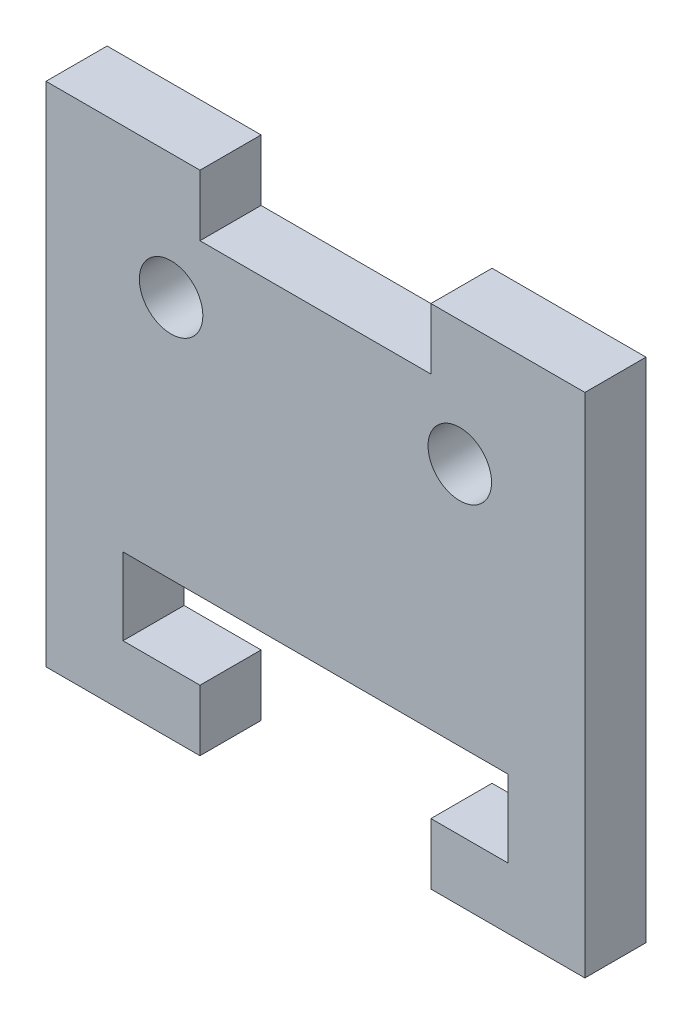
ISO-10303-21;
HEADER;
FILE_DESCRIPTION(('STEP AP214'),'2;1');
FILE_NAME('part.step','',(''),(''),'','','');
FILE_SCHEMA(('AUTOMOTIVE_DESIGN { 1 0 10303 214 1 1 1 1 }'));
ENDSEC;
DATA;
#1=APPLICATION_CONTEXT('core data for automotive mechanical design processes');
#2=APPLICATION_PROTOCOL_DEFINITION('international standard','automotive_design',2000,#1);
#3=PRODUCT_CONTEXT('',#1,'mechanical');
#4=PRODUCT('Part','Part','',(#3));
#5=PRODUCT_RELATED_PRODUCT_CATEGORY('part','',(#4));
#6=PRODUCT_DEFINITION_FORMATION('','',#4);
#7=PRODUCT_DEFINITION_CONTEXT('part definition',#1,'design');
#8=PRODUCT_DEFINITION('design','',#6,#7);
#9=PRODUCT_DEFINITION_SHAPE('','',#8);
#10=(LENGTH_UNIT() NAMED_UNIT(*) SI_UNIT(.MILLI.,.METRE.));
#11=(NAMED_UNIT(*) PLANE_ANGLE_UNIT() SI_UNIT($,.RADIAN.));
#12=(NAMED_UNIT(*) SI_UNIT($,.STERADIAN.) SOLID_ANGLE_UNIT());
#13=UNCERTAINTY_MEASURE_WITH_UNIT(LENGTH_MEASURE(1.E-05),#10,'distance_accuracy_value','');
#14=(GEOMETRIC_REPRESENTATION_CONTEXT(3) GLOBAL_UNCERTAINTY_ASSIGNED_CONTEXT((#13)) GLOBAL_UNIT_ASSIGNED_CONTEXT((#10,
#11,#12)) REPRESENTATION_CONTEXT('',''));
#15=CARTESIAN_POINT('',(0.,0.,0.));
#16=DIRECTION('',(0.,0.,1.));
#17=DIRECTION('',(1.,0.,0.));
#18=AXIS2_PLACEMENT_3D('',#15,#16,#17);
#19=CARTESIAN_POINT('',(10.,0.,3.175));
#20=DIRECTION('',(-1.,0.,0.));
#21=DIRECTION('',(0.,0.,1.));
#22=AXIS2_PLACEMENT_3D('',#19,#20,#21);
#23=PLANE('',#22);
#24=DIRECTION('',(0.,1.,0.));
#25=VECTOR('',#24,1.);
#26=CARTESIAN_POINT('',(10.,0.,0.));
#27=LINE('',#26,#25);
#28=CARTESIAN_POINT('',(10.,-10.,0.));
#29=VERTEX_POINT('',#28);
#30=CARTESIAN_POINT('',(10.,-6.,0.));
#31=VERTEX_POINT('',#30);
#32=EDGE_CURVE('E241',#29,#31,#27,.T.);
#33=ORIENTED_EDGE('',*,*,#32,.F.);
#34=DIRECTION('',(0.,0.,-1.));
#35=VECTOR('',#34,1.);
#36=CARTESIAN_POINT('',(10.,-10.,3.175));
#37=LINE('',#36,#35);
#38=CARTESIAN_POINT('',(10.,-10.,3.175));
#39=VERTEX_POINT('',#38);
#40=EDGE_CURVE('E11',#39,#29,#37,.T.);
#41=ORIENTED_EDGE('',*,*,#40,.F.);
#42=DIRECTION('',(0.,1.,0.));
#43=VECTOR('',#42,1.);
#44=CARTESIAN_POINT('',(10.,0.,3.175));
#45=LINE('',#44,#43);
#46=CARTESIAN_POINT('',(10.,-6.,3.175));
#47=VERTEX_POINT('',#46);
#48=EDGE_CURVE('E182',#39,#47,#45,.T.);
#49=ORIENTED_EDGE('',*,*,#48,.T.);
#50=DIRECTION('',(0.,0.,-1.));
#51=VECTOR('',#50,1.);
#52=CARTESIAN_POINT('',(10.,-6.,3.175));
#53=LINE('',#52,#51);
#54=EDGE_CURVE('E111',#47,#31,#53,.T.);
#55=ORIENTED_EDGE('',*,*,#54,.T.);
#56=EDGE_LOOP('',(#33,#41,#49,#55));
#57=FACE_BOUND('',#56,.T.);
#58=ADVANCED_FACE('F35',(#57),#23,.T.);
#59=CARTESIAN_POINT('',(0.,-10.,3.175));
#60=DIRECTION('',(0.,1.,0.));
#61=DIRECTION('',(0.,0.,1.));
#62=AXIS2_PLACEMENT_3D('',#59,#60,#61);
#63=PLANE('',#62);
#64=DIRECTION('',(1.,0.,0.));
#65=VECTOR('',#64,1.);
#66=CARTESIAN_POINT('',(0.,-10.,0.));
#67=LINE('',#66,#65);
#68=CARTESIAN_POINT('',(6.,-10.,0.));
#69=VERTEX_POINT('',#68);
#70=EDGE_CURVE('E236',#69,#29,#67,.T.);
#71=ORIENTED_EDGE('',*,*,#70,.F.);
#72=DIRECTION('',(0.,0.,-1.));
#73=VECTOR('',#72,1.);
#74=CARTESIAN_POINT('',(6.,-10.,3.175));
#75=LINE('',#74,#73);
#76=CARTESIAN_POINT('',(6.,-10.,3.175));
#77=VERTEX_POINT('',#76);
#78=EDGE_CURVE('E44',#77,#69,#75,.T.);
#79=ORIENTED_EDGE('',*,*,#78,.F.);
#80=DIRECTION('',(1.,0.,0.));
#81=VECTOR('',#80,1.);
#82=CARTESIAN_POINT('',(0.,-10.,3.175));
#83=LINE('',#82,#81);
#84=EDGE_CURVE('E175',#77,#39,#83,.T.);
#85=ORIENTED_EDGE('',*,*,#84,.T.);
#86=ORIENTED_EDGE('',*,*,#40,.T.);
#87=EDGE_LOOP('',(#71,#79,#85,#86));
#88=FACE_BOUND('',#87,.T.);
#89=ADVANCED_FACE('F240',(#88),#63,.T.);
#90=CARTESIAN_POINT('',(6.,0.,3.175));
#91=DIRECTION('',(1.,0.,0.));
#92=DIRECTION('',(0.,0.,-1.));
#93=AXIS2_PLACEMENT_3D('',#90,#91,#92);
#94=PLANE('',#93);
#95=DIRECTION('',(0.,-1.,0.));
#96=VECTOR('',#95,1.);
#97=CARTESIAN_POINT('',(6.,0.,0.));
#98=LINE('',#97,#96);
#99=CARTESIAN_POINT('',(6.,-13.175,0.));
#100=VERTEX_POINT('',#99);
#101=EDGE_CURVE('E232',#69,#100,#98,.T.);
#102=ORIENTED_EDGE('',*,*,#101,.T.);
#103=DIRECTION('',(0.,0.,-1.));
#104=VECTOR('',#103,1.);
#105=CARTESIAN_POINT('',(6.,-13.175,3.175));
#106=LINE('',#105,#104);
#107=CARTESIAN_POINT('',(6.,-13.175,3.175));
#108=VERTEX_POINT('',#107);
#109=EDGE_CURVE('E224',#108,#100,#106,.T.);
#110=ORIENTED_EDGE('',*,*,#109,.F.);
#111=DIRECTION('',(0.,-1.,0.));
#112=VECTOR('',#111,1.);
#113=CARTESIAN_POINT('',(6.,0.,3.175));
#114=LINE('',#113,#112);
#115=EDGE_CURVE('E181',#77,#108,#114,.T.);
#116=ORIENTED_EDGE('',*,*,#115,.F.);
#117=ORIENTED_EDGE('',*,*,#78,.T.);
#118=EDGE_LOOP('',(#102,#110,#116,#117));
#119=FACE_BOUND('',#118,.T.);
#120=ADVANCED_FACE('F230',(#119),#94,.F.);
#121=CARTESIAN_POINT('',(0.,-13.175,3.175));
#122=DIRECTION('',(0.,1.,0.));
#123=DIRECTION('',(0.,0.,1.));
#124=AXIS2_PLACEMENT_3D('',#121,#122,#123);
#125=PLANE('',#124);
#126=DIRECTION('',(1.,0.,0.));
#127=VECTOR('',#126,1.);
#128=CARTESIAN_POINT('',(0.,-13.175,0.));
#129=LINE('',#128,#127);
#130=CARTESIAN_POINT('',(14.,-13.175,0.));
#131=VERTEX_POINT('',#130);
#132=EDGE_CURVE('E238',#100,#131,#129,.T.);
#133=ORIENTED_EDGE('',*,*,#132,.T.);
#134=DIRECTION('',(0.,0.,-1.));
#135=VECTOR('',#134,1.);
#136=CARTESIAN_POINT('',(14.,-13.175,3.175));
#137=LINE('',#136,#135);
#138=CARTESIAN_POINT('',(14.,-13.175,3.175));
#139=VERTEX_POINT('',#138);
#140=EDGE_CURVE('E221',#139,#131,#137,.T.);
#141=ORIENTED_EDGE('',*,*,#140,.F.);
#142=DIRECTION('',(1.,0.,0.));
#143=VECTOR('',#142,1.);
#144=CARTESIAN_POINT('',(0.,-13.175,3.175));
#145=LINE('',#144,#143);
#146=EDGE_CURVE('E186',#108,#139,#145,.T.);
#147=ORIENTED_EDGE('',*,*,#146,.F.);
#148=ORIENTED_EDGE('',*,*,#109,.T.);
#149=EDGE_LOOP('',(#133,#141,#147,#148));
#150=FACE_BOUND('',#149,.T.);
#151=ADVANCED_FACE('F275',(#150),#125,.F.);
#152=CARTESIAN_POINT('',(14.,0.,3.175));
#153=DIRECTION('',(-1.,0.,0.));
#154=DIRECTION('',(0.,0.,1.));
#155=AXIS2_PLACEMENT_3D('',#152,#153,#154);
#156=PLANE('',#155);
#157=DIRECTION('',(0.,1.,0.));
#158=VECTOR('',#157,1.);
#159=CARTESIAN_POINT('',(14.,0.,0.));
#160=LINE('',#159,#158);
#161=CARTESIAN_POINT('',(14.,13.175,0.));
#162=VERTEX_POINT('',#161);
#163=EDGE_CURVE('E270',#131,#162,#160,.T.);
#164=ORIENTED_EDGE('',*,*,#163,.T.);
#165=DIRECTION('',(0.,0.,-1.));
#166=VECTOR('',#165,1.);
#167=CARTESIAN_POINT('',(14.,13.175,3.175));
#168=LINE('',#167,#166);
#169=CARTESIAN_POINT('',(14.,13.175,3.175));
#170=VERTEX_POINT('',#169);
#171=EDGE_CURVE('E219',#170,#162,#168,.T.);
#172=ORIENTED_EDGE('',*,*,#171,.F.);
#173=DIRECTION('',(0.,1.,0.));
#174=VECTOR('',#173,1.);
#175=CARTESIAN_POINT('',(14.,0.,3.175));
#176=LINE('',#175,#174);
#177=EDGE_CURVE('E277',#139,#170,#176,.T.);
#178=ORIENTED_EDGE('',*,*,#177,.F.);
#179=ORIENTED_EDGE('',*,*,#140,.T.);
#180=EDGE_LOOP('',(#164,#172,#178,#179));
#181=FACE_BOUND('',#180,.T.);
#182=ADVANCED_FACE('F328',(#181),#156,.F.);
#183=CARTESIAN_POINT('',(0.,13.175,3.175));
#184=DIRECTION('',(0.,1.,0.));
#185=DIRECTION('',(0.,0.,1.));
#186=AXIS2_PLACEMENT_3D('',#183,#184,#185);
#187=PLANE('',#186);
#188=DIRECTION('',(1.,0.,0.));
#189=VECTOR('',#188,1.);
#190=CARTESIAN_POINT('',(0.,13.175,0.));
#191=LINE('',#190,#189);
#192=CARTESIAN_POINT('',(6.,13.175,0.));
#193=VERTEX_POINT('',#192);
#194=EDGE_CURVE('E267',#193,#162,#191,.T.);
#195=ORIENTED_EDGE('',*,*,#194,.F.);
#196=DIRECTION('',(0.,0.,-1.));
#197=VECTOR('',#196,1.);
#198=CARTESIAN_POINT('',(6.,13.175,3.175));
#199=LINE('',#198,#197);
#200=CARTESIAN_POINT('',(6.,13.175,3.175));
#201=VERTEX_POINT('',#200);
#202=EDGE_CURVE('E217',#201,#193,#199,.T.);
#203=ORIENTED_EDGE('',*,*,#202,.F.);
#204=DIRECTION('',(1.,0.,0.));
#205=VECTOR('',#204,1.);
#206=CARTESIAN_POINT('',(0.,13.175,3.175));
#207=LINE('',#206,#205);
#208=EDGE_CURVE('E279',#201,#170,#207,.T.);
#209=ORIENTED_EDGE('',*,*,#208,.T.);
#210=ORIENTED_EDGE('',*,*,#171,.T.);
#211=EDGE_LOOP('',(#195,#203,#209,#210));
#212=FACE_BOUND('',#211,.T.);
#213=ADVANCED_FACE('F331',(#212),#187,.T.);
#214=CARTESIAN_POINT('',(6.,0.,3.175));
#215=DIRECTION('',(-1.,0.,0.));
#216=DIRECTION('',(0.,0.,1.));
#217=AXIS2_PLACEMENT_3D('',#214,#215,#216);
#218=PLANE('',#217);
#219=DIRECTION('',(0.,1.,0.));
#220=VECTOR('',#219,1.);
#221=CARTESIAN_POINT('',(6.,0.,0.));
#222=LINE('',#221,#220);
#223=CARTESIAN_POINT('',(6.,10.,0.));
#224=VERTEX_POINT('',#223);
#225=EDGE_CURVE('E264',#224,#193,#222,.T.);
#226=ORIENTED_EDGE('',*,*,#225,.F.);
#227=DIRECTION('',(0.,0.,-1.));
#228=VECTOR('',#227,1.);
#229=CARTESIAN_POINT('',(6.,10.,3.175));
#230=LINE('',#229,#228);
#231=CARTESIAN_POINT('',(6.,10.,3.175));
#232=VERTEX_POINT('',#231);
#233=EDGE_CURVE('E215',#232,#224,#230,.T.);
#234=ORIENTED_EDGE('',*,*,#233,.F.);
#235=DIRECTION('',(0.,1.,0.));
#236=VECTOR('',#235,1.);
#237=CARTESIAN_POINT('',(6.,0.,3.175));
#238=LINE('',#237,#236);
#239=EDGE_CURVE('E284',#232,#201,#238,.T.);
#240=ORIENTED_EDGE('',*,*,#239,.T.);
#241=ORIENTED_EDGE('',*,*,#202,.T.);
#242=EDGE_LOOP('',(#226,#234,#240,#241));
#243=FACE_BOUND('',#242,.T.);
#244=ADVANCED_FACE('F335',(#243),#218,.T.);
#245=CARTESIAN_POINT('',(0.,10.,3.175));
#246=DIRECTION('',(0.,1.,0.));
#247=DIRECTION('',(0.,0.,1.));
#248=AXIS2_PLACEMENT_3D('',#245,#246,#247);
#249=PLANE('',#248);
#250=DIRECTION('',(1.,0.,0.));
#251=VECTOR('',#250,1.);
#252=CARTESIAN_POINT('',(0.,10.,0.));
#253=LINE('',#252,#251);
#254=CARTESIAN_POINT('',(-6.,10.,0.));
#255=VERTEX_POINT('',#254);
#256=EDGE_CURVE('E261',#255,#224,#253,.T.);
#257=ORIENTED_EDGE('',*,*,#256,.F.);
#258=DIRECTION('',(0.,0.,-1.));
#259=VECTOR('',#258,1.);
#260=CARTESIAN_POINT('',(-6.,10.,3.175));
#261=LINE('',#260,#259);
#262=CARTESIAN_POINT('',(-6.,10.,3.175));
#263=VERTEX_POINT('',#262);
#264=EDGE_CURVE('E213',#263,#255,#261,.T.);
#265=ORIENTED_EDGE('',*,*,#264,.F.);
#266=DIRECTION('',(1.,0.,0.));
#267=VECTOR('',#266,1.);
#268=CARTESIAN_POINT('',(0.,10.,3.175));
#269=LINE('',#268,#267);
#270=EDGE_CURVE('E287',#263,#232,#269,.T.);
#271=ORIENTED_EDGE('',*,*,#270,.T.);
#272=ORIENTED_EDGE('',*,*,#233,.T.);
#273=EDGE_LOOP('',(#257,#265,#271,#272));
#274=FACE_BOUND('',#273,.T.);
#275=ADVANCED_FACE('F339',(#274),#249,.T.);
#276=CARTESIAN_POINT('',(-6.,0.,3.175));
#277=DIRECTION('',(1.,0.,0.));
#278=DIRECTION('',(0.,0.,-1.));
#279=AXIS2_PLACEMENT_3D('',#276,#277,#278);
#280=PLANE('',#279);
#281=DIRECTION('',(0.,-1.,0.));
#282=VECTOR('',#281,1.);
#283=CARTESIAN_POINT('',(-6.,0.,0.));
#284=LINE('',#283,#282);
#285=CARTESIAN_POINT('',(-6.,13.175,0.));
#286=VERTEX_POINT('',#285);
#287=EDGE_CURVE('E258',#286,#255,#284,.T.);
#288=ORIENTED_EDGE('',*,*,#287,.F.);
#289=DIRECTION('',(0.,0.,-1.));
#290=VECTOR('',#289,1.);
#291=CARTESIAN_POINT('',(-6.,13.175,3.175));
#292=LINE('',#291,#290);
#293=CARTESIAN_POINT('',(-6.,13.175,3.175));
#294=VERTEX_POINT('',#293);
#295=EDGE_CURVE('E211',#294,#286,#292,.T.);
#296=ORIENTED_EDGE('',*,*,#295,.F.);
#297=DIRECTION('',(0.,-1.,0.));
#298=VECTOR('',#297,1.);
#299=CARTESIAN_POINT('',(-6.,0.,3.175));
#300=LINE('',#299,#298);
#301=EDGE_CURVE('E290',#294,#263,#300,.T.);
#302=ORIENTED_EDGE('',*,*,#301,.T.);
#303=ORIENTED_EDGE('',*,*,#264,.T.);
#304=EDGE_LOOP('',(#288,#296,#302,#303));
#305=FACE_BOUND('',#304,.T.);
#306=ADVANCED_FACE('F343',(#305),#280,.T.);
#307=CARTESIAN_POINT('',(0.,13.175,3.175));
#308=DIRECTION('',(0.,1.,0.));
#309=DIRECTION('',(0.,0.,1.));
#310=AXIS2_PLACEMENT_3D('',#307,#308,#309);
#311=PLANE('',#310);
#312=DIRECTION('',(1.,0.,0.));
#313=VECTOR('',#312,1.);
#314=CARTESIAN_POINT('',(0.,13.175,0.));
#315=LINE('',#314,#313);
#316=CARTESIAN_POINT('',(-14.,13.175,0.));
#317=VERTEX_POINT('',#316);
#318=EDGE_CURVE('E255',#317,#286,#315,.T.);
#319=ORIENTED_EDGE('',*,*,#318,.F.);
#320=DIRECTION('',(0.,0.,-1.));
#321=VECTOR('',#320,1.);
#322=CARTESIAN_POINT('',(-14.,13.175,3.175));
#323=LINE('',#322,#321);
#324=CARTESIAN_POINT('',(-14.,13.175,3.175));
#325=VERTEX_POINT('',#324);
#326=EDGE_CURVE('E209',#325,#317,#323,.T.);
#327=ORIENTED_EDGE('',*,*,#326,.F.);
#328=DIRECTION('',(1.,0.,0.));
#329=VECTOR('',#328,1.);
#330=CARTESIAN_POINT('',(0.,13.175,3.175));
#331=LINE('',#330,#329);
#332=EDGE_CURVE('E293',#325,#294,#331,.T.);
#333=ORIENTED_EDGE('',*,*,#332,.T.);
#334=ORIENTED_EDGE('',*,*,#295,.T.);
#335=EDGE_LOOP('',(#319,#327,#333,#334));
#336=FACE_BOUND('',#335,.T.);
#337=ADVANCED_FACE('F347',(#336),#311,.T.);
#338=CARTESIAN_POINT('',(-14.,0.,3.175));
#339=DIRECTION('',(-1.,0.,0.));
#340=DIRECTION('',(0.,0.,1.));
#341=AXIS2_PLACEMENT_3D('',#338,#339,#340);
#342=PLANE('',#341);
#343=DIRECTION('',(0.,1.,0.));
#344=VECTOR('',#343,1.);
#345=CARTESIAN_POINT('',(-14.,0.,0.));
#346=LINE('',#345,#344);
#347=CARTESIAN_POINT('',(-14.,-13.175,0.));
#348=VERTEX_POINT('',#347);
#349=EDGE_CURVE('E250',#348,#317,#346,.T.);
#350=ORIENTED_EDGE('',*,*,#349,.F.);
#351=DIRECTION('',(0.,0.,-1.));
#352=VECTOR('',#351,1.);
#353=CARTESIAN_POINT('',(-14.,-13.175,3.175));
#354=LINE('',#353,#352);
#355=CARTESIAN_POINT('',(-14.,-13.175,3.175));
#356=VERTEX_POINT('',#355);
#357=EDGE_CURVE('E207',#356,#348,#354,.T.);
#358=ORIENTED_EDGE('',*,*,#357,.F.);
#359=DIRECTION('',(0.,1.,0.));
#360=VECTOR('',#359,1.);
#361=CARTESIAN_POINT('',(-14.,0.,3.175));
#362=LINE('',#361,#360);
#363=EDGE_CURVE('E296',#356,#325,#362,.T.);
#364=ORIENTED_EDGE('',*,*,#363,.T.);
#365=ORIENTED_EDGE('',*,*,#326,.T.);
#366=EDGE_LOOP('',(#350,#358,#364,#365));
#367=FACE_BOUND('',#366,.T.);
#368=ADVANCED_FACE('F351',(#367),#342,.T.);
#369=CARTESIAN_POINT('',(0.,-13.175,3.175));
#370=DIRECTION('',(0.,1.,0.));
#371=DIRECTION('',(0.,0.,1.));
#372=AXIS2_PLACEMENT_3D('',#369,#370,#371);
#373=PLANE('',#372);
#374=DIRECTION('',(1.,0.,0.));
#375=VECTOR('',#374,1.);
#376=CARTESIAN_POINT('',(0.,-13.175,0.));
#377=LINE('',#376,#375);
#378=CARTESIAN_POINT('',(-6.,-13.175,0.));
#379=VERTEX_POINT('',#378);
#380=EDGE_CURVE('E247',#348,#379,#377,.T.);
#381=ORIENTED_EDGE('',*,*,#380,.T.);
#382=DIRECTION('',(0.,0.,-1.));
#383=VECTOR('',#382,1.);
#384=CARTESIAN_POINT('',(-6.,-13.175,3.175));
#385=LINE('',#384,#383);
#386=CARTESIAN_POINT('',(-6.,-13.175,3.175));
#387=VERTEX_POINT('',#386);
#388=EDGE_CURVE('E204',#387,#379,#385,.T.);
#389=ORIENTED_EDGE('',*,*,#388,.F.);
#390=DIRECTION('',(1.,0.,0.));
#391=VECTOR('',#390,1.);
#392=CARTESIAN_POINT('',(0.,-13.175,3.175));
#393=LINE('',#392,#391);
#394=EDGE_CURVE('E176',#356,#387,#393,.T.);
#395=ORIENTED_EDGE('',*,*,#394,.F.);
#396=ORIENTED_EDGE('',*,*,#357,.T.);
#397=EDGE_LOOP('',(#381,#389,#395,#396));
#398=FACE_BOUND('',#397,.T.);
#399=ADVANCED_FACE('F355',(#398),#373,.F.);
#400=CARTESIAN_POINT('',(-6.,0.,3.175));
#401=DIRECTION('',(-1.,0.,0.));
#402=DIRECTION('',(0.,0.,1.));
#403=AXIS2_PLACEMENT_3D('',#400,#401,#402);
#404=PLANE('',#403);
#405=DIRECTION('',(0.,1.,0.));
#406=VECTOR('',#405,1.);
#407=CARTESIAN_POINT('',(-6.,0.,0.));
#408=LINE('',#407,#406);
#409=CARTESIAN_POINT('',(-6.,-10.,0.));
#410=VERTEX_POINT('',#409);
#411=EDGE_CURVE('E245',#379,#410,#408,.T.);
#412=ORIENTED_EDGE('',*,*,#411,.T.);
#413=DIRECTION('',(0.,0.,-1.));
#414=VECTOR('',#413,1.);
#415=CARTESIAN_POINT('',(-6.,-10.,3.175));
#416=LINE('',#415,#414);
#417=CARTESIAN_POINT('',(-6.,-10.,3.175));
#418=VERTEX_POINT('',#417);
#419=EDGE_CURVE('E163',#418,#410,#416,.T.);
#420=ORIENTED_EDGE('',*,*,#419,.F.);
#421=DIRECTION('',(0.,1.,0.));
#422=VECTOR('',#421,1.);
#423=CARTESIAN_POINT('',(-6.,0.,3.175));
#424=LINE('',#423,#422);
#425=EDGE_CURVE('E172',#387,#418,#424,.T.);
#426=ORIENTED_EDGE('',*,*,#425,.F.);
#427=ORIENTED_EDGE('',*,*,#388,.T.);
#428=EDGE_LOOP('',(#412,#420,#426,#427));
#429=FACE_BOUND('',#428,.T.);
#430=ADVANCED_FACE('F359',(#429),#404,.F.);
#431=CARTESIAN_POINT('',(-10.,-10.,0.));
#432=VERTEX_POINT('',#431);
#433=EDGE_CURVE('E160',#432,#410,#67,.T.);
#434=ORIENTED_EDGE('',*,*,#433,.F.);
#435=DIRECTION('',(0.,0.,-1.));
#436=VECTOR('',#435,1.);
#437=CARTESIAN_POINT('',(-10.,-10.,3.175));
#438=LINE('',#437,#436);
#439=CARTESIAN_POINT('',(-10.,-10.,3.175));
#440=VERTEX_POINT('',#439);
#441=EDGE_CURVE('E154',#440,#432,#438,.T.);
#442=ORIENTED_EDGE('',*,*,#441,.F.);
#443=EDGE_CURVE('E158',#440,#418,#83,.T.);
#444=ORIENTED_EDGE('',*,*,#443,.T.);
#445=ORIENTED_EDGE('',*,*,#419,.T.);
#446=EDGE_LOOP('',(#434,#442,#444,#445));
#447=FACE_BOUND('',#446,.T.);
#448=ADVANCED_FACE('F156',(#447),#63,.T.);
#449=CARTESIAN_POINT('',(-10.,0.,3.175));
#450=DIRECTION('',(-1.,0.,0.));
#451=DIRECTION('',(0.,0.,1.));
#452=AXIS2_PLACEMENT_3D('',#449,#450,#451);
#453=PLANE('',#452);
#454=DIRECTION('',(0.,1.,0.));
#455=VECTOR('',#454,1.);
#456=CARTESIAN_POINT('',(-10.,0.,0.));
#457=LINE('',#456,#455);
#458=CARTESIAN_POINT('',(-10.,-6.,0.));
#459=VERTEX_POINT('',#458);
#460=EDGE_CURVE('E195',#432,#459,#457,.T.);
#461=ORIENTED_EDGE('',*,*,#460,.T.);
#462=DIRECTION('',(0.,0.,-1.));
#463=VECTOR('',#462,1.);
#464=CARTESIAN_POINT('',(-10.,-6.,3.175));
#465=LINE('',#464,#463);
#466=CARTESIAN_POINT('',(-10.,-6.,3.175));
#467=VERTEX_POINT('',#466);
#468=EDGE_CURVE('E164',#467,#459,#465,.T.);
#469=ORIENTED_EDGE('',*,*,#468,.F.);
#470=DIRECTION('',(0.,1.,0.));
#471=VECTOR('',#470,1.);
#472=CARTESIAN_POINT('',(-10.,0.,3.175));
#473=LINE('',#472,#471);
#474=EDGE_CURVE('E167',#440,#467,#473,.T.);
#475=ORIENTED_EDGE('',*,*,#474,.F.);
#476=ORIENTED_EDGE('',*,*,#441,.T.);
#477=EDGE_LOOP('',(#461,#469,#475,#476));
#478=FACE_BOUND('',#477,.T.);
#479=ADVANCED_FACE('F168',(#478),#453,.F.);
#480=CARTESIAN_POINT('',(7.5,6.7,3.175));
#481=DIRECTION('',(0.,0.,-1.));
#482=DIRECTION('',(-1.,0.,0.));
#483=AXIS2_PLACEMENT_3D('',#480,#481,#482);
#484=CYLINDRICAL_SURFACE('',#483,1.65);
#485=CARTESIAN_POINT('',(7.5,6.7,3.175));
#486=DIRECTION('',(0.,0.,1.));
#487=DIRECTION('',(1.,0.,0.));
#488=AXIS2_PLACEMENT_3D('',#485,#486,#487);
#489=CIRCLE('',#488,1.65);
#490=CARTESIAN_POINT('',(9.15,6.7,3.175));
#491=VERTEX_POINT('',#490);
#492=EDGE_CURVE('E187',#491,#491,#489,.T.);
#493=ORIENTED_EDGE('',*,*,#492,.T.);
#494=EDGE_LOOP('',(#493));
#495=FACE_BOUND('',#494,.T.);
#496=CARTESIAN_POINT('',(7.5,6.7,0.));
#497=DIRECTION('',(0.,0.,1.));
#498=DIRECTION('',(1.,0.,0.));
#499=AXIS2_PLACEMENT_3D('',#496,#497,#498);
#500=CIRCLE('',#499,1.65);
#501=CARTESIAN_POINT('',(9.15,6.7,0.));
#502=VERTEX_POINT('',#501);
#503=EDGE_CURVE('E243',#502,#502,#500,.T.);
#504=ORIENTED_EDGE('',*,*,#503,.F.);
#505=EDGE_LOOP('',(#504));
#506=FACE_BOUND('',#505,.T.);
#507=ADVANCED_FACE('F308',(#495,#506),#484,.F.);
#508=CARTESIAN_POINT('',(-7.5,6.7,3.175));
#509=DIRECTION('',(0.,0.,-1.));
#510=DIRECTION('',(-1.,0.,0.));
#511=AXIS2_PLACEMENT_3D('',#508,#509,#510);
#512=CYLINDRICAL_SURFACE('',#511,1.65);
#513=CARTESIAN_POINT('',(-7.5,6.7,3.175));
#514=DIRECTION('',(0.,0.,1.));
#515=DIRECTION('',(1.,0.,0.));
#516=AXIS2_PLACEMENT_3D('',#513,#514,#515);
#517=CIRCLE('',#516,1.65);
#518=CARTESIAN_POINT('',(-5.85,6.7,3.175));
#519=VERTEX_POINT('',#518);
#520=EDGE_CURVE('E189',#519,#519,#517,.T.);
#521=ORIENTED_EDGE('',*,*,#520,.T.);
#522=EDGE_LOOP('',(#521));
#523=FACE_BOUND('',#522,.T.);
#524=CARTESIAN_POINT('',(-7.5,6.7,0.));
#525=DIRECTION('',(0.,0.,1.));
#526=DIRECTION('',(1.,0.,0.));
#527=AXIS2_PLACEMENT_3D('',#524,#525,#526);
#528=CIRCLE('',#527,1.65);
#529=CARTESIAN_POINT('',(-5.85,6.7,0.));
#530=VERTEX_POINT('',#529);
#531=EDGE_CURVE('E301',#530,#530,#528,.T.);
#532=ORIENTED_EDGE('',*,*,#531,.F.);
#533=EDGE_LOOP('',(#532));
#534=FACE_BOUND('',#533,.T.);
#535=ADVANCED_FACE('F37',(#523,#534),#512,.F.);
#536=CARTESIAN_POINT('',(0.,-6.,3.175));
#537=DIRECTION('',(0.,1.,0.));
#538=DIRECTION('',(0.,0.,1.));
#539=AXIS2_PLACEMENT_3D('',#536,#537,#538);
#540=PLANE('',#539);
#541=DIRECTION('',(1.,0.,0.));
#542=VECTOR('',#541,1.);
#543=CARTESIAN_POINT('',(0.,-6.,0.));
#544=LINE('',#543,#542);
#545=EDGE_CURVE('E104',#459,#31,#544,.T.);
#546=ORIENTED_EDGE('',*,*,#545,.T.);
#547=ORIENTED_EDGE('',*,*,#54,.F.);
#548=DIRECTION('',(1.,0.,0.));
#549=VECTOR('',#548,1.);
#550=CARTESIAN_POINT('',(0.,-6.,3.175));
#551=LINE('',#550,#549);
#552=EDGE_CURVE('E52',#467,#47,#551,.T.);
#553=ORIENTED_EDGE('',*,*,#552,.F.);
#554=ORIENTED_EDGE('',*,*,#468,.T.);
#555=EDGE_LOOP('',(#546,#547,#553,#554));
#556=FACE_BOUND('',#555,.T.);
#557=ADVANCED_FACE('F315',(#556),#540,.F.);
#558=CARTESIAN_POINT('',(0.,0.,3.175));
#559=DIRECTION('',(0.,0.,1.));
#560=DIRECTION('',(1.,0.,0.));
#561=AXIS2_PLACEMENT_3D('',#558,#559,#560);
#562=PLANE('',#561);
#563=ORIENTED_EDGE('',*,*,#520,.F.);
#564=EDGE_LOOP('',(#563));
#565=FACE_BOUND('',#564,.T.);
#566=ORIENTED_EDGE('',*,*,#492,.F.);
#567=EDGE_LOOP('',(#566));
#568=FACE_BOUND('',#567,.T.);
#569=ORIENTED_EDGE('',*,*,#48,.F.);
#570=ORIENTED_EDGE('',*,*,#84,.F.);
#571=ORIENTED_EDGE('',*,*,#115,.T.);
#572=ORIENTED_EDGE('',*,*,#146,.T.);
#573=ORIENTED_EDGE('',*,*,#177,.T.);
#574=ORIENTED_EDGE('',*,*,#208,.F.);
#575=ORIENTED_EDGE('',*,*,#239,.F.);
#576=ORIENTED_EDGE('',*,*,#270,.F.);
#577=ORIENTED_EDGE('',*,*,#301,.F.);
#578=ORIENTED_EDGE('',*,*,#332,.F.);
#579=ORIENTED_EDGE('',*,*,#363,.F.);
#580=ORIENTED_EDGE('',*,*,#394,.T.);
#581=ORIENTED_EDGE('',*,*,#425,.T.);
#582=ORIENTED_EDGE('',*,*,#443,.F.);
#583=ORIENTED_EDGE('',*,*,#474,.T.);
#584=ORIENTED_EDGE('',*,*,#552,.T.);
#585=EDGE_LOOP('',(#569,#570,#571,#572,#573,#574,#575,#576,#577,#578,#579,#580,#581,#582,#583,#584));
#586=FACE_BOUND('',#585,.T.);
#587=ADVANCED_FACE('F170',(#565,#568,#586),#562,.T.);
#588=CARTESIAN_POINT('',(0.,0.,0.));
#589=DIRECTION('',(0.,0.,1.));
#590=DIRECTION('',(1.,0.,0.));
#591=AXIS2_PLACEMENT_3D('',#588,#589,#590);
#592=PLANE('',#591);
#593=ORIENTED_EDGE('',*,*,#531,.T.);
#594=EDGE_LOOP('',(#593));
#595=FACE_BOUND('',#594,.T.);
#596=ORIENTED_EDGE('',*,*,#503,.T.);
#597=EDGE_LOOP('',(#596));
#598=FACE_BOUND('',#597,.T.);
#599=ORIENTED_EDGE('',*,*,#32,.T.);
#600=ORIENTED_EDGE('',*,*,#545,.F.);
#601=ORIENTED_EDGE('',*,*,#460,.F.);
#602=ORIENTED_EDGE('',*,*,#433,.T.);
#603=ORIENTED_EDGE('',*,*,#411,.F.);
#604=ORIENTED_EDGE('',*,*,#380,.F.);
#605=ORIENTED_EDGE('',*,*,#349,.T.);
#606=ORIENTED_EDGE('',*,*,#318,.T.);
#607=ORIENTED_EDGE('',*,*,#287,.T.);
#608=ORIENTED_EDGE('',*,*,#256,.T.);
#609=ORIENTED_EDGE('',*,*,#225,.T.);
#610=ORIENTED_EDGE('',*,*,#194,.T.);
#611=ORIENTED_EDGE('',*,*,#163,.F.);
#612=ORIENTED_EDGE('',*,*,#132,.F.);
#613=ORIENTED_EDGE('',*,*,#101,.F.);
#614=ORIENTED_EDGE('',*,*,#70,.T.);
#615=EDGE_LOOP('',(#599,#600,#601,#602,#603,#604,#605,#606,#607,#608,#609,#610,#611,#612,#613,#614));
#616=FACE_BOUND('',#615,.T.);
#617=ADVANCED_FACE('F235',(#595,#598,#616),#592,.F.);
#618=CLOSED_SHELL('',(#58,#89,#120,#151,#182,#213,#244,#275,#306,#337,#368,#399,#430,#448,#479,
#507,#535,#557,#587,#617));
#619=MANIFOLD_SOLID_BREP('B2',#618);
#620=ADVANCED_BREP_SHAPE_REPRESENTATION('',(#18,#619),#14);
#621=SHAPE_DEFINITION_REPRESENTATION(#9,#620);
ENDSEC;
END-ISO-10303-21;
